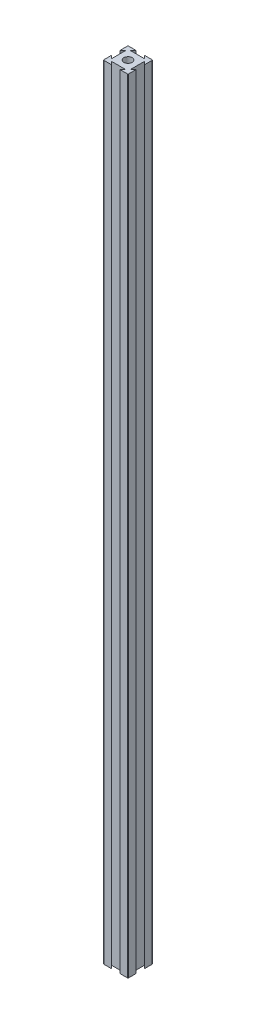
ISO-10303-21;
HEADER;
FILE_DESCRIPTION(('STEP AP214'),'2;1');
FILE_NAME('part.step','',(''),(''),'','','');
FILE_SCHEMA(('AUTOMOTIVE_DESIGN { 1 0 10303 214 1 1 1 1 }'));
ENDSEC;
DATA;
#1=APPLICATION_CONTEXT('core data for automotive mechanical design processes');
#2=APPLICATION_PROTOCOL_DEFINITION('international standard','automotive_design',2000,#1);
#3=PRODUCT_CONTEXT('',#1,'mechanical');
#4=PRODUCT('Part','Part','',(#3));
#5=PRODUCT_RELATED_PRODUCT_CATEGORY('part','',(#4));
#6=PRODUCT_DEFINITION_FORMATION('','',#4);
#7=PRODUCT_DEFINITION_CONTEXT('part definition',#1,'design');
#8=PRODUCT_DEFINITION('design','',#6,#7);
#9=PRODUCT_DEFINITION_SHAPE('','',#8);
#10=(LENGTH_UNIT() NAMED_UNIT(*) SI_UNIT(.MILLI.,.METRE.));
#11=(NAMED_UNIT(*) PLANE_ANGLE_UNIT() SI_UNIT($,.RADIAN.));
#12=(NAMED_UNIT(*) SI_UNIT($,.STERADIAN.) SOLID_ANGLE_UNIT());
#13=UNCERTAINTY_MEASURE_WITH_UNIT(LENGTH_MEASURE(1.E-05),#10,'distance_accuracy_value','');
#14=(GEOMETRIC_REPRESENTATION_CONTEXT(3) GLOBAL_UNCERTAINTY_ASSIGNED_CONTEXT((#13)) GLOBAL_UNIT_ASSIGNED_CONTEXT((#10,
#11,#12)) REPRESENTATION_CONTEXT('',''));
#15=CARTESIAN_POINT('',(0.,0.,0.));
#16=DIRECTION('',(0.,0.,1.));
#17=DIRECTION('',(1.,0.,0.));
#18=AXIS2_PLACEMENT_3D('',#15,#16,#17);
#19=CARTESIAN_POINT('',(16.6666666666667,635.,-16.6666666666667));
#20=DIRECTION('',(-0.707106781186547,0.,0.707106781186548));
#21=DIRECTION('',(0.707106781186548,0.,0.707106781186547));
#22=AXIS2_PLACEMENT_3D('',#19,#20,#21);
#23=PLANE('',#22);
#24=DIRECTION('',(-0.707106781186548,0.,-0.707106781186547));
#25=VECTOR('',#24,1.);
#26=CARTESIAN_POINT('',(16.6666666666667,0.,-16.6666666666667));
#27=LINE('',#26,#25);
#28=CARTESIAN_POINT('',(20.,0.,-13.3333333333333));
#29=VERTEX_POINT('',#28);
#30=CARTESIAN_POINT('',(17.6183333333333,0.,-15.715));
#31=VERTEX_POINT('',#30);
#32=EDGE_CURVE('E201',#29,#31,#27,.T.);
#33=ORIENTED_EDGE('',*,*,#32,.F.);
#34=DIRECTION('',(0.,-1.,0.));
#35=VECTOR('',#34,1.);
#36=CARTESIAN_POINT('',(20.,635.,-13.3333333333333));
#37=LINE('',#36,#35);
#38=CARTESIAN_POINT('',(20.,635.,-13.3333333333333));
#39=VERTEX_POINT('',#38);
#40=EDGE_CURVE('E195',#39,#29,#37,.T.);
#41=ORIENTED_EDGE('',*,*,#40,.F.);
#42=DIRECTION('',(-0.707106781186548,0.,-0.707106781186547));
#43=VECTOR('',#42,1.);
#44=CARTESIAN_POINT('',(16.6666666666667,635.,-16.6666666666667));
#45=LINE('',#44,#43);
#46=CARTESIAN_POINT('',(17.6183333333333,635.,-15.715));
#47=VERTEX_POINT('',#46);
#48=EDGE_CURVE('E198',#39,#47,#45,.T.);
#49=ORIENTED_EDGE('',*,*,#48,.T.);
#50=DIRECTION('',(0.,-1.,0.));
#51=VECTOR('',#50,1.);
#52=CARTESIAN_POINT('',(17.6183333333333,635.,-15.715));
#53=LINE('',#52,#51);
#54=EDGE_CURVE('E269',#47,#31,#53,.T.);
#55=ORIENTED_EDGE('',*,*,#54,.T.);
#56=EDGE_LOOP('',(#33,#41,#49,#55));
#57=FACE_BOUND('',#56,.T.);
#58=ADVANCED_FACE('F35',(#57),#23,.T.);
#59=CARTESIAN_POINT('',(20.,635.,0.));
#60=DIRECTION('',(-1.,0.,0.));
#61=DIRECTION('',(0.,0.,1.));
#62=AXIS2_PLACEMENT_3D('',#59,#60,#61);
#63=PLANE('',#62);
#64=DIRECTION('',(0.,0.,-1.));
#65=VECTOR('',#64,1.);
#66=CARTESIAN_POINT('',(20.,0.,0.));
#67=LINE('',#66,#65);
#68=CARTESIAN_POINT('',(20.,0.,-19.492));
#69=VERTEX_POINT('',#68);
#70=EDGE_CURVE('E274',#29,#69,#67,.T.);
#71=ORIENTED_EDGE('',*,*,#70,.T.);
#72=DIRECTION('',(0.,-1.,0.));
#73=VECTOR('',#72,1.);
#74=CARTESIAN_POINT('',(20.,635.,-19.492));
#75=LINE('',#74,#73);
#76=CARTESIAN_POINT('',(20.,635.,-19.492));
#77=VERTEX_POINT('',#76);
#78=EDGE_CURVE('E212',#69,#77,#75,.F.);
#79=ORIENTED_EDGE('',*,*,#78,.T.);
#80=DIRECTION('',(0.,0.,-1.));
#81=VECTOR('',#80,1.);
#82=CARTESIAN_POINT('',(20.,635.,0.));
#83=LINE('',#82,#81);
#84=EDGE_CURVE('E209',#39,#77,#83,.T.);
#85=ORIENTED_EDGE('',*,*,#84,.F.);
#86=ORIENTED_EDGE('',*,*,#40,.T.);
#87=EDGE_LOOP('',(#71,#79,#85,#86));
#88=FACE_BOUND('',#87,.T.);
#89=ADVANCED_FACE('F210',(#88),#63,.F.);
#90=CARTESIAN_POINT('',(0.,635.,-20.));
#91=DIRECTION('',(0.,0.,-1.));
#92=DIRECTION('',(-1.,0.,0.));
#93=AXIS2_PLACEMENT_3D('',#90,#91,#92);
#94=PLANE('',#93);
#95=DIRECTION('',(1.,0.,0.));
#96=VECTOR('',#95,1.);
#97=CARTESIAN_POINT('',(0.,635.,-20.));
#98=LINE('',#97,#96);
#99=CARTESIAN_POINT('',(13.3333333333333,635.,-20.));
#100=VERTEX_POINT('',#99);
#101=CARTESIAN_POINT('',(19.492,635.,-20.));
#102=VERTEX_POINT('',#101);
#103=EDGE_CURVE('E214',#100,#102,#98,.T.);
#104=ORIENTED_EDGE('',*,*,#103,.T.);
#105=DIRECTION('',(0.,-1.,0.));
#106=VECTOR('',#105,1.);
#107=CARTESIAN_POINT('',(19.492,0.,-20.));
#108=LINE('',#107,#106);
#109=CARTESIAN_POINT('',(19.492,0.,-20.));
#110=VERTEX_POINT('',#109);
#111=EDGE_CURVE('E376',#102,#110,#108,.T.);
#112=ORIENTED_EDGE('',*,*,#111,.T.);
#113=DIRECTION('',(1.,0.,0.));
#114=VECTOR('',#113,1.);
#115=CARTESIAN_POINT('',(0.,0.,-20.));
#116=LINE('',#115,#114);
#117=CARTESIAN_POINT('',(13.3333333333333,0.,-20.));
#118=VERTEX_POINT('',#117);
#119=EDGE_CURVE('E276',#118,#110,#116,.T.);
#120=ORIENTED_EDGE('',*,*,#119,.F.);
#121=DIRECTION('',(0.,-1.,0.));
#122=VECTOR('',#121,1.);
#123=CARTESIAN_POINT('',(13.3333333333333,635.,-20.));
#124=LINE('',#123,#122);
#125=EDGE_CURVE('E206',#100,#118,#124,.T.);
#126=ORIENTED_EDGE('',*,*,#125,.F.);
#127=EDGE_LOOP('',(#104,#112,#120,#126));
#128=FACE_BOUND('',#127,.T.);
#129=ADVANCED_FACE('F408',(#128),#94,.T.);
#130=CARTESIAN_POINT('',(16.6666666666666,635.,-16.6666666666668));
#131=DIRECTION('',(-0.707106781186544,0.,0.707106781186551));
#132=DIRECTION('',(0.707106781186551,0.,0.707106781186544));
#133=AXIS2_PLACEMENT_3D('',#130,#131,#132);
#134=PLANE('',#133);
#135=DIRECTION('',(-0.707106781186551,0.,-0.707106781186544));
#136=VECTOR('',#135,1.);
#137=CARTESIAN_POINT('',(16.6666666666666,0.,-16.6666666666668));
#138=LINE('',#137,#136);
#139=CARTESIAN_POINT('',(15.715,0.,-17.6183333333334));
#140=VERTEX_POINT('',#139);
#141=EDGE_CURVE('E280',#140,#118,#138,.T.);
#142=ORIENTED_EDGE('',*,*,#141,.F.);
#143=DIRECTION('',(0.,-1.,0.));
#144=VECTOR('',#143,1.);
#145=CARTESIAN_POINT('',(15.715,635.,-17.6183333333334));
#146=LINE('',#145,#144);
#147=CARTESIAN_POINT('',(15.715,635.,-17.6183333333334));
#148=VERTEX_POINT('',#147);
#149=EDGE_CURVE('E354',#148,#140,#146,.T.);
#150=ORIENTED_EDGE('',*,*,#149,.F.);
#151=DIRECTION('',(-0.707106781186551,0.,-0.707106781186544));
#152=VECTOR('',#151,1.);
#153=CARTESIAN_POINT('',(16.6666666666666,635.,-16.6666666666668));
#154=LINE('',#153,#152);
#155=EDGE_CURVE('E230',#148,#100,#154,.T.);
#156=ORIENTED_EDGE('',*,*,#155,.T.);
#157=ORIENTED_EDGE('',*,*,#125,.T.);
#158=EDGE_LOOP('',(#142,#150,#156,#157));
#159=FACE_BOUND('',#158,.T.);
#160=ADVANCED_FACE('F412',(#159),#134,.T.);
#161=CARTESIAN_POINT('',(0.,635.,-17.6183333333334));
#162=DIRECTION('',(0.,0.,-1.));
#163=DIRECTION('',(-1.,0.,0.));
#164=AXIS2_PLACEMENT_3D('',#161,#162,#163);
#165=PLANE('',#164);
#166=DIRECTION('',(1.,0.,0.));
#167=VECTOR('',#166,1.);
#168=CARTESIAN_POINT('',(0.,0.,-17.6183333333334));
#169=LINE('',#168,#167);
#170=CARTESIAN_POINT('',(4.285,0.,-17.6183333333334));
#171=VERTEX_POINT('',#170);
#172=EDGE_CURVE('E284',#171,#140,#169,.T.);
#173=ORIENTED_EDGE('',*,*,#172,.F.);
#174=DIRECTION('',(0.,-1.,0.));
#175=VECTOR('',#174,1.);
#176=CARTESIAN_POINT('',(4.285,635.,-17.6183333333334));
#177=LINE('',#176,#175);
#178=CARTESIAN_POINT('',(4.285,635.,-17.6183333333334));
#179=VERTEX_POINT('',#178);
#180=EDGE_CURVE('E352',#179,#171,#177,.T.);
#181=ORIENTED_EDGE('',*,*,#180,.F.);
#182=DIRECTION('',(1.,0.,0.));
#183=VECTOR('',#182,1.);
#184=CARTESIAN_POINT('',(0.,635.,-17.6183333333334));
#185=LINE('',#184,#183);
#186=EDGE_CURVE('E234',#179,#148,#185,.T.);
#187=ORIENTED_EDGE('',*,*,#186,.T.);
#188=ORIENTED_EDGE('',*,*,#149,.T.);
#189=EDGE_LOOP('',(#173,#181,#187,#188));
#190=FACE_BOUND('',#189,.T.);
#191=ADVANCED_FACE('F439',(#190),#165,.T.);
#192=CARTESIAN_POINT('',(-6.6666666666667,635.,-6.66666666666677));
#193=DIRECTION('',(0.707106781186544,0.,0.707106781186551));
#194=DIRECTION('',(0.707106781186551,0.,-0.707106781186544));
#195=AXIS2_PLACEMENT_3D('',#192,#193,#194);
#196=PLANE('',#195);
#197=DIRECTION('',(-0.707106781186551,0.,0.707106781186544));
#198=VECTOR('',#197,1.);
#199=CARTESIAN_POINT('',(-6.6666666666667,0.,-6.66666666666677));
#200=LINE('',#199,#198);
#201=CARTESIAN_POINT('',(6.66666666666666,0.,-20.));
#202=VERTEX_POINT('',#201);
#203=EDGE_CURVE('E287',#202,#171,#200,.T.);
#204=ORIENTED_EDGE('',*,*,#203,.F.);
#205=DIRECTION('',(0.,-1.,0.));
#206=VECTOR('',#205,1.);
#207=CARTESIAN_POINT('',(6.66666666666666,635.,-20.));
#208=LINE('',#207,#206);
#209=CARTESIAN_POINT('',(6.66666666666666,635.,-20.));
#210=VERTEX_POINT('',#209);
#211=EDGE_CURVE('E349',#210,#202,#208,.T.);
#212=ORIENTED_EDGE('',*,*,#211,.F.);
#213=DIRECTION('',(-0.707106781186551,0.,0.707106781186544));
#214=VECTOR('',#213,1.);
#215=CARTESIAN_POINT('',(-6.6666666666667,635.,-6.66666666666677));
#216=LINE('',#215,#214);
#217=EDGE_CURVE('E237',#210,#179,#216,.T.);
#218=ORIENTED_EDGE('',*,*,#217,.T.);
#219=ORIENTED_EDGE('',*,*,#180,.T.);
#220=EDGE_LOOP('',(#204,#212,#218,#219));
#221=FACE_BOUND('',#220,.T.);
#222=ADVANCED_FACE('F442',(#221),#196,.T.);
#223=CARTESIAN_POINT('',(0.508,0.,-20.));
#224=VERTEX_POINT('',#223);
#225=EDGE_CURVE('E281',#224,#202,#116,.T.);
#226=ORIENTED_EDGE('',*,*,#225,.F.);
#227=DIRECTION('',(0.,-1.,0.));
#228=VECTOR('',#227,1.);
#229=CARTESIAN_POINT('',(0.508,635.,-20.));
#230=LINE('',#229,#228);
#231=CARTESIAN_POINT('',(0.508,635.,-20.));
#232=VERTEX_POINT('',#231);
#233=EDGE_CURVE('E367',#224,#232,#230,.F.);
#234=ORIENTED_EDGE('',*,*,#233,.T.);
#235=EDGE_CURVE('E231',#232,#210,#98,.T.);
#236=ORIENTED_EDGE('',*,*,#235,.T.);
#237=ORIENTED_EDGE('',*,*,#211,.T.);
#238=EDGE_LOOP('',(#226,#234,#236,#237));
#239=FACE_BOUND('',#238,.T.);
#240=ADVANCED_FACE('F505',(#239),#94,.T.);
#241=CARTESIAN_POINT('',(0.,635.,0.));
#242=DIRECTION('',(-1.,0.,0.));
#243=DIRECTION('',(0.,0.,1.));
#244=AXIS2_PLACEMENT_3D('',#241,#242,#243);
#245=PLANE('',#244);
#246=DIRECTION('',(0.,0.,-1.));
#247=VECTOR('',#246,1.);
#248=CARTESIAN_POINT('',(0.,635.,0.));
#249=LINE('',#248,#247);
#250=CARTESIAN_POINT('',(0.,635.,-13.3333333333333));
#251=VERTEX_POINT('',#250);
#252=CARTESIAN_POINT('',(0.,635.,-19.492));
#253=VERTEX_POINT('',#252);
#254=EDGE_CURVE('E240',#251,#253,#249,.T.);
#255=ORIENTED_EDGE('',*,*,#254,.T.);
#256=DIRECTION('',(0.,-1.,0.));
#257=VECTOR('',#256,1.);
#258=CARTESIAN_POINT('',(0.,635.,-19.492));
#259=LINE('',#258,#257);
#260=CARTESIAN_POINT('',(0.,0.,-19.492));
#261=VERTEX_POINT('',#260);
#262=EDGE_CURVE('E205',#253,#261,#259,.T.);
#263=ORIENTED_EDGE('',*,*,#262,.T.);
#264=DIRECTION('',(0.,0.,-1.));
#265=VECTOR('',#264,1.);
#266=CARTESIAN_POINT('',(0.,0.,0.));
#267=LINE('',#266,#265);
#268=CARTESIAN_POINT('',(0.,0.,-13.3333333333333));
#269=VERTEX_POINT('',#268);
#270=EDGE_CURVE('E290',#269,#261,#267,.T.);
#271=ORIENTED_EDGE('',*,*,#270,.F.);
#272=DIRECTION('',(0.,-1.,0.));
#273=VECTOR('',#272,1.);
#274=CARTESIAN_POINT('',(0.,635.,-13.3333333333333));
#275=LINE('',#274,#273);
#276=EDGE_CURVE('E347',#251,#269,#275,.T.);
#277=ORIENTED_EDGE('',*,*,#276,.F.);
#278=EDGE_LOOP('',(#255,#263,#271,#277));
#279=FACE_BOUND('',#278,.T.);
#280=ADVANCED_FACE('F451',(#279),#245,.T.);
#281=CARTESIAN_POINT('',(-6.66666666666667,635.,-6.66666666666669));
#282=DIRECTION('',(-0.707106781186546,0.,-0.707106781186548));
#283=DIRECTION('',(-0.707106781186549,0.,0.707106781186547));
#284=AXIS2_PLACEMENT_3D('',#281,#282,#283);
#285=PLANE('',#284);
#286=DIRECTION('',(0.707106781186549,0.,-0.707106781186547));
#287=VECTOR('',#286,1.);
#288=CARTESIAN_POINT('',(-6.66666666666667,0.,-6.66666666666669));
#289=LINE('',#288,#287);
#290=CARTESIAN_POINT('',(2.38166666666667,0.,-15.715));
#291=VERTEX_POINT('',#290);
#292=EDGE_CURVE('E293',#269,#291,#289,.T.);
#293=ORIENTED_EDGE('',*,*,#292,.T.);
#294=DIRECTION('',(0.,-1.,0.));
#295=VECTOR('',#294,1.);
#296=CARTESIAN_POINT('',(2.38166666666667,635.,-15.715));
#297=LINE('',#296,#295);
#298=CARTESIAN_POINT('',(2.38166666666667,635.,-15.715));
#299=VERTEX_POINT('',#298);
#300=EDGE_CURVE('E344',#299,#291,#297,.T.);
#301=ORIENTED_EDGE('',*,*,#300,.F.);
#302=DIRECTION('',(0.707106781186549,0.,-0.707106781186547));
#303=VECTOR('',#302,1.);
#304=CARTESIAN_POINT('',(-6.66666666666667,635.,-6.66666666666669));
#305=LINE('',#304,#303);
#306=EDGE_CURVE('E243',#251,#299,#305,.T.);
#307=ORIENTED_EDGE('',*,*,#306,.F.);
#308=ORIENTED_EDGE('',*,*,#276,.T.);
#309=EDGE_LOOP('',(#293,#301,#307,#308));
#310=FACE_BOUND('',#309,.T.);
#311=ADVANCED_FACE('F456',(#310),#285,.F.);
#312=CARTESIAN_POINT('',(2.38166666666667,635.,0.));
#313=DIRECTION('',(1.,0.,0.));
#314=DIRECTION('',(0.,0.,-1.));
#315=AXIS2_PLACEMENT_3D('',#312,#313,#314);
#316=PLANE('',#315);
#317=DIRECTION('',(0.,0.,1.));
#318=VECTOR('',#317,1.);
#319=CARTESIAN_POINT('',(2.38166666666667,0.,0.));
#320=LINE('',#319,#318);
#321=CARTESIAN_POINT('',(2.38166666666667,0.,-4.285));
#322=VERTEX_POINT('',#321);
#323=EDGE_CURVE('E297',#291,#322,#320,.T.);
#324=ORIENTED_EDGE('',*,*,#323,.T.);
#325=DIRECTION('',(0.,-1.,0.));
#326=VECTOR('',#325,1.);
#327=CARTESIAN_POINT('',(2.38166666666667,635.,-4.285));
#328=LINE('',#327,#326);
#329=CARTESIAN_POINT('',(2.38166666666667,635.,-4.285));
#330=VERTEX_POINT('',#329);
#331=EDGE_CURVE('E341',#330,#322,#328,.T.);
#332=ORIENTED_EDGE('',*,*,#331,.F.);
#333=DIRECTION('',(0.,0.,1.));
#334=VECTOR('',#333,1.);
#335=CARTESIAN_POINT('',(2.38166666666667,635.,0.));
#336=LINE('',#335,#334);
#337=EDGE_CURVE('E247',#299,#330,#336,.T.);
#338=ORIENTED_EDGE('',*,*,#337,.F.);
#339=ORIENTED_EDGE('',*,*,#300,.T.);
#340=EDGE_LOOP('',(#324,#332,#338,#339));
#341=FACE_BOUND('',#340,.T.);
#342=ADVANCED_FACE('F462',(#341),#316,.F.);
#343=CARTESIAN_POINT('',(3.33333333333333,635.,-3.33333333333335));
#344=DIRECTION('',(-0.707106781186546,0.,0.707106781186549));
#345=DIRECTION('',(0.707106781186549,0.,0.707106781186546));
#346=AXIS2_PLACEMENT_3D('',#343,#344,#345);
#347=PLANE('',#346);
#348=DIRECTION('',(-0.707106781186549,0.,-0.707106781186546));
#349=VECTOR('',#348,1.);
#350=CARTESIAN_POINT('',(3.33333333333333,0.,-3.33333333333335));
#351=LINE('',#350,#349);
#352=CARTESIAN_POINT('',(0.,0.,-6.66666666666667));
#353=VERTEX_POINT('',#352);
#354=EDGE_CURVE('E300',#322,#353,#351,.T.);
#355=ORIENTED_EDGE('',*,*,#354,.T.);
#356=DIRECTION('',(0.,-1.,0.));
#357=VECTOR('',#356,1.);
#358=CARTESIAN_POINT('',(0.,635.,-6.66666666666667));
#359=LINE('',#358,#357);
#360=CARTESIAN_POINT('',(0.,635.,-6.66666666666667));
#361=VERTEX_POINT('',#360);
#362=EDGE_CURVE('E338',#361,#353,#359,.T.);
#363=ORIENTED_EDGE('',*,*,#362,.F.);
#364=DIRECTION('',(-0.707106781186549,0.,-0.707106781186546));
#365=VECTOR('',#364,1.);
#366=CARTESIAN_POINT('',(3.33333333333333,635.,-3.33333333333335));
#367=LINE('',#366,#365);
#368=EDGE_CURVE('E250',#330,#361,#367,.T.);
#369=ORIENTED_EDGE('',*,*,#368,.F.);
#370=ORIENTED_EDGE('',*,*,#331,.T.);
#371=EDGE_LOOP('',(#355,#363,#369,#370));
#372=FACE_BOUND('',#371,.T.);
#373=ADVANCED_FACE('F464',(#372),#347,.F.);
#374=CARTESIAN_POINT('',(0.,0.,-0.508));
#375=VERTEX_POINT('',#374);
#376=EDGE_CURVE('E294',#375,#353,#267,.T.);
#377=ORIENTED_EDGE('',*,*,#376,.F.);
#378=DIRECTION('',(0.,-1.,0.));
#379=VECTOR('',#378,1.);
#380=CARTESIAN_POINT('',(0.,635.,-0.508));
#381=LINE('',#380,#379);
#382=CARTESIAN_POINT('',(0.,635.,-0.508));
#383=VERTEX_POINT('',#382);
#384=EDGE_CURVE('E383',#375,#383,#381,.F.);
#385=ORIENTED_EDGE('',*,*,#384,.T.);
#386=EDGE_CURVE('E244',#383,#361,#249,.T.);
#387=ORIENTED_EDGE('',*,*,#386,.T.);
#388=ORIENTED_EDGE('',*,*,#362,.T.);
#389=EDGE_LOOP('',(#377,#385,#387,#388));
#390=FACE_BOUND('',#389,.T.);
#391=ADVANCED_FACE('F467',(#390),#245,.T.);
#392=CARTESIAN_POINT('',(0.,635.,0.));
#393=DIRECTION('',(0.,0.,-1.));
#394=DIRECTION('',(-1.,0.,0.));
#395=AXIS2_PLACEMENT_3D('',#392,#393,#394);
#396=PLANE('',#395);
#397=DIRECTION('',(1.,0.,0.));
#398=VECTOR('',#397,1.);
#399=CARTESIAN_POINT('',(0.,635.,0.));
#400=LINE('',#399,#398);
#401=CARTESIAN_POINT('',(0.508,635.,0.));
#402=VERTEX_POINT('',#401);
#403=CARTESIAN_POINT('',(6.66666666666667,635.,0.));
#404=VERTEX_POINT('',#403);
#405=EDGE_CURVE('E253',#402,#404,#400,.T.);
#406=ORIENTED_EDGE('',*,*,#405,.F.);
#407=DIRECTION('',(0.,-1.,0.));
#408=VECTOR('',#407,1.);
#409=CARTESIAN_POINT('',(0.508,0.,0.));
#410=LINE('',#409,#408);
#411=CARTESIAN_POINT('',(0.508,0.,0.));
#412=VERTEX_POINT('',#411);
#413=EDGE_CURVE('E380',#402,#412,#410,.T.);
#414=ORIENTED_EDGE('',*,*,#413,.T.);
#415=DIRECTION('',(1.,0.,0.));
#416=VECTOR('',#415,1.);
#417=CARTESIAN_POINT('',(0.,0.,0.));
#418=LINE('',#417,#416);
#419=CARTESIAN_POINT('',(6.66666666666667,0.,0.));
#420=VERTEX_POINT('',#419);
#421=EDGE_CURVE('E303',#412,#420,#418,.T.);
#422=ORIENTED_EDGE('',*,*,#421,.T.);
#423=DIRECTION('',(0.,-1.,0.));
#424=VECTOR('',#423,1.);
#425=CARTESIAN_POINT('',(6.66666666666667,635.,0.));
#426=LINE('',#425,#424);
#427=EDGE_CURVE('E335',#404,#420,#426,.T.);
#428=ORIENTED_EDGE('',*,*,#427,.F.);
#429=EDGE_LOOP('',(#406,#414,#422,#428));
#430=FACE_BOUND('',#429,.T.);
#431=ADVANCED_FACE('F474',(#430),#396,.F.);
#432=CARTESIAN_POINT('',(3.3333333333333,635.,-3.33333333333333));
#433=DIRECTION('',(-0.707106781186544,0.,0.707106781186551));
#434=DIRECTION('',(0.707106781186551,0.,0.707106781186544));
#435=AXIS2_PLACEMENT_3D('',#432,#433,#434);
#436=PLANE('',#435);
#437=DIRECTION('',(-0.707106781186551,0.,-0.707106781186544));
#438=VECTOR('',#437,1.);
#439=CARTESIAN_POINT('',(3.3333333333333,0.,-3.33333333333333));
#440=LINE('',#439,#438);
#441=CARTESIAN_POINT('',(4.285,0.,-2.38166666666664));
#442=VERTEX_POINT('',#441);
#443=EDGE_CURVE('E305',#420,#442,#440,.T.);
#444=ORIENTED_EDGE('',*,*,#443,.T.);
#445=DIRECTION('',(0.,-1.,0.));
#446=VECTOR('',#445,1.);
#447=CARTESIAN_POINT('',(4.285,635.,-2.38166666666664));
#448=LINE('',#447,#446);
#449=CARTESIAN_POINT('',(4.285,635.,-2.38166666666664));
#450=VERTEX_POINT('',#449);
#451=EDGE_CURVE('E332',#450,#442,#448,.T.);
#452=ORIENTED_EDGE('',*,*,#451,.F.);
#453=DIRECTION('',(-0.707106781186551,0.,-0.707106781186544));
#454=VECTOR('',#453,1.);
#455=CARTESIAN_POINT('',(3.3333333333333,635.,-3.33333333333333));
#456=LINE('',#455,#454);
#457=EDGE_CURVE('E255',#404,#450,#456,.T.);
#458=ORIENTED_EDGE('',*,*,#457,.F.);
#459=ORIENTED_EDGE('',*,*,#427,.T.);
#460=EDGE_LOOP('',(#444,#452,#458,#459));
#461=FACE_BOUND('',#460,.T.);
#462=ADVANCED_FACE('F480',(#461),#436,.F.);
#463=CARTESIAN_POINT('',(0.,635.,-2.38166666666664));
#464=DIRECTION('',(0.,0.,-1.));
#465=DIRECTION('',(-1.,0.,0.));
#466=AXIS2_PLACEMENT_3D('',#463,#464,#465);
#467=PLANE('',#466);
#468=DIRECTION('',(1.,0.,0.));
#469=VECTOR('',#468,1.);
#470=CARTESIAN_POINT('',(0.,0.,-2.38166666666664));
#471=LINE('',#470,#469);
#472=CARTESIAN_POINT('',(15.715,0.,-2.38166666666664));
#473=VERTEX_POINT('',#472);
#474=EDGE_CURVE('E309',#442,#473,#471,.T.);
#475=ORIENTED_EDGE('',*,*,#474,.T.);
#476=DIRECTION('',(0.,-1.,0.));
#477=VECTOR('',#476,1.);
#478=CARTESIAN_POINT('',(15.715,635.,-2.38166666666664));
#479=LINE('',#478,#477);
#480=CARTESIAN_POINT('',(15.715,635.,-2.38166666666664));
#481=VERTEX_POINT('',#480);
#482=EDGE_CURVE('E329',#481,#473,#479,.T.);
#483=ORIENTED_EDGE('',*,*,#482,.F.);
#484=DIRECTION('',(1.,0.,0.));
#485=VECTOR('',#484,1.);
#486=CARTESIAN_POINT('',(0.,635.,-2.38166666666664));
#487=LINE('',#486,#485);
#488=EDGE_CURVE('E259',#450,#481,#487,.T.);
#489=ORIENTED_EDGE('',*,*,#488,.F.);
#490=ORIENTED_EDGE('',*,*,#451,.T.);
#491=EDGE_LOOP('',(#475,#483,#489,#490));
#492=FACE_BOUND('',#491,.T.);
#493=ADVANCED_FACE('F483',(#492),#467,.F.);
#494=CARTESIAN_POINT('',(6.66666666666659,635.,6.66666666666667));
#495=DIRECTION('',(0.707106781186544,0.,0.707106781186551));
#496=DIRECTION('',(0.707106781186551,0.,-0.707106781186544));
#497=AXIS2_PLACEMENT_3D('',#494,#495,#496);
#498=PLANE('',#497);
#499=DIRECTION('',(-0.707106781186551,0.,0.707106781186544));
#500=VECTOR('',#499,1.);
#501=CARTESIAN_POINT('',(6.66666666666659,0.,6.66666666666667));
#502=LINE('',#501,#500);
#503=CARTESIAN_POINT('',(13.3333333333333,0.,0.));
#504=VERTEX_POINT('',#503);
#505=EDGE_CURVE('E312',#473,#504,#502,.T.);
#506=ORIENTED_EDGE('',*,*,#505,.T.);
#507=DIRECTION('',(0.,-1.,0.));
#508=VECTOR('',#507,1.);
#509=CARTESIAN_POINT('',(13.3333333333333,635.,0.));
#510=LINE('',#509,#508);
#511=CARTESIAN_POINT('',(13.3333333333333,635.,0.));
#512=VERTEX_POINT('',#511);
#513=EDGE_CURVE('E326',#512,#504,#510,.T.);
#514=ORIENTED_EDGE('',*,*,#513,.F.);
#515=DIRECTION('',(-0.707106781186551,0.,0.707106781186544));
#516=VECTOR('',#515,1.);
#517=CARTESIAN_POINT('',(6.66666666666659,635.,6.66666666666667));
#518=LINE('',#517,#516);
#519=EDGE_CURVE('E262',#481,#512,#518,.T.);
#520=ORIENTED_EDGE('',*,*,#519,.F.);
#521=ORIENTED_EDGE('',*,*,#482,.T.);
#522=EDGE_LOOP('',(#506,#514,#520,#521));
#523=FACE_BOUND('',#522,.T.);
#524=ADVANCED_FACE('F485',(#523),#498,.F.);
#525=CARTESIAN_POINT('',(19.492,0.,0.));
#526=VERTEX_POINT('',#525);
#527=EDGE_CURVE('E306',#504,#526,#418,.T.);
#528=ORIENTED_EDGE('',*,*,#527,.T.);
#529=DIRECTION('',(0.,-1.,0.));
#530=VECTOR('',#529,1.);
#531=CARTESIAN_POINT('',(19.492,635.,0.));
#532=LINE('',#531,#530);
#533=CARTESIAN_POINT('',(19.492,635.,0.));
#534=VERTEX_POINT('',#533);
#535=EDGE_CURVE('E11',#526,#534,#532,.F.);
#536=ORIENTED_EDGE('',*,*,#535,.T.);
#537=EDGE_CURVE('E256',#512,#534,#400,.T.);
#538=ORIENTED_EDGE('',*,*,#537,.F.);
#539=ORIENTED_EDGE('',*,*,#513,.T.);
#540=EDGE_LOOP('',(#528,#536,#538,#539));
#541=FACE_BOUND('',#540,.T.);
#542=ADVANCED_FACE('F394',(#541),#396,.F.);
#543=CARTESIAN_POINT('',(20.,635.,-0.508));
#544=VERTEX_POINT('',#543);
#545=CARTESIAN_POINT('',(20.,635.,-6.66666666666667));
#546=VERTEX_POINT('',#545);
#547=EDGE_CURVE('E216',#544,#546,#83,.T.);
#548=ORIENTED_EDGE('',*,*,#547,.F.);
#549=DIRECTION('',(0.,-1.,0.));
#550=VECTOR('',#549,1.);
#551=CARTESIAN_POINT('',(20.,635.,-0.508));
#552=LINE('',#551,#550);
#553=CARTESIAN_POINT('',(20.,0.,-0.508));
#554=VERTEX_POINT('',#553);
#555=EDGE_CURVE('E43',#544,#554,#552,.T.);
#556=ORIENTED_EDGE('',*,*,#555,.T.);
#557=CARTESIAN_POINT('',(20.,0.,-6.66666666666667));
#558=VERTEX_POINT('',#557);
#559=EDGE_CURVE('E277',#554,#558,#67,.T.);
#560=ORIENTED_EDGE('',*,*,#559,.T.);
#561=DIRECTION('',(0.,-1.,0.));
#562=VECTOR('',#561,1.);
#563=CARTESIAN_POINT('',(20.,635.,-6.66666666666667));
#564=LINE('',#563,#562);
#565=EDGE_CURVE('E323',#546,#558,#564,.T.);
#566=ORIENTED_EDGE('',*,*,#565,.F.);
#567=EDGE_LOOP('',(#548,#556,#560,#566));
#568=FACE_BOUND('',#567,.T.);
#569=ADVANCED_FACE('F388',(#568),#63,.F.);
#570=CARTESIAN_POINT('',(6.66666666666663,635.,6.66666666666666));
#571=DIRECTION('',(-0.707106781186546,0.,-0.707106781186549));
#572=DIRECTION('',(-0.707106781186549,0.,0.707106781186546));
#573=AXIS2_PLACEMENT_3D('',#570,#571,#572);
#574=PLANE('',#573);
#575=DIRECTION('',(0.707106781186549,0.,-0.707106781186546));
#576=VECTOR('',#575,1.);
#577=CARTESIAN_POINT('',(6.66666666666663,0.,6.66666666666666));
#578=LINE('',#577,#576);
#579=CARTESIAN_POINT('',(17.6183333333333,0.,-4.285));
#580=VERTEX_POINT('',#579);
#581=EDGE_CURVE('E315',#580,#558,#578,.T.);
#582=ORIENTED_EDGE('',*,*,#581,.F.);
#583=DIRECTION('',(0.,-1.,0.));
#584=VECTOR('',#583,1.);
#585=CARTESIAN_POINT('',(17.6183333333333,635.,-4.285));
#586=LINE('',#585,#584);
#587=CARTESIAN_POINT('',(17.6183333333333,635.,-4.285));
#588=VERTEX_POINT('',#587);
#589=EDGE_CURVE('E321',#588,#580,#586,.T.);
#590=ORIENTED_EDGE('',*,*,#589,.F.);
#591=DIRECTION('',(0.707106781186549,0.,-0.707106781186546));
#592=VECTOR('',#591,1.);
#593=CARTESIAN_POINT('',(6.66666666666663,635.,6.66666666666666));
#594=LINE('',#593,#592);
#595=EDGE_CURVE('E265',#588,#546,#594,.T.);
#596=ORIENTED_EDGE('',*,*,#595,.T.);
#597=ORIENTED_EDGE('',*,*,#565,.T.);
#598=EDGE_LOOP('',(#582,#590,#596,#597));
#599=FACE_BOUND('',#598,.T.);
#600=ADVANCED_FACE('F418',(#599),#574,.T.);
#601=CARTESIAN_POINT('',(10.,635.,-10.));
#602=DIRECTION('',(0.,-1.,0.));
#603=DIRECTION('',(0.,0.,-1.));
#604=AXIS2_PLACEMENT_3D('',#601,#602,#603);
#605=CYLINDRICAL_SURFACE('',#604,3.33333333333333);
#606=CARTESIAN_POINT('',(10.,635.,-10.));
#607=DIRECTION('',(0.,1.,0.));
#608=DIRECTION('',(0.,0.,1.));
#609=AXIS2_PLACEMENT_3D('',#606,#607,#608);
#610=CIRCLE('',#609,3.33333333333333);
#611=CARTESIAN_POINT('',(10.,635.,-6.66666666666667));
#612=VERTEX_POINT('',#611);
#613=EDGE_CURVE('E222',#612,#612,#610,.T.);
#614=ORIENTED_EDGE('',*,*,#613,.T.);
#615=EDGE_LOOP('',(#614));
#616=FACE_BOUND('',#615,.T.);
#617=CARTESIAN_POINT('',(10.,0.,-10.));
#618=DIRECTION('',(0.,1.,0.));
#619=DIRECTION('',(0.,0.,1.));
#620=AXIS2_PLACEMENT_3D('',#617,#618,#619);
#621=CIRCLE('',#620,3.33333333333333);
#622=CARTESIAN_POINT('',(10.,0.,-6.66666666666667));
#623=VERTEX_POINT('',#622);
#624=EDGE_CURVE('E270',#623,#623,#621,.T.);
#625=ORIENTED_EDGE('',*,*,#624,.F.);
#626=EDGE_LOOP('',(#625));
#627=FACE_BOUND('',#626,.T.);
#628=ADVANCED_FACE('F414',(#616,#627),#605,.F.);
#629=CARTESIAN_POINT('',(17.6183333333333,635.,0.));
#630=DIRECTION('',(1.,0.,0.));
#631=DIRECTION('',(0.,0.,-1.));
#632=AXIS2_PLACEMENT_3D('',#629,#630,#631);
#633=PLANE('',#632);
#634=DIRECTION('',(0.,0.,1.));
#635=VECTOR('',#634,1.);
#636=CARTESIAN_POINT('',(17.6183333333333,0.,0.));
#637=LINE('',#636,#635);
#638=EDGE_CURVE('E225',#31,#580,#637,.T.);
#639=ORIENTED_EDGE('',*,*,#638,.F.);
#640=ORIENTED_EDGE('',*,*,#54,.F.);
#641=DIRECTION('',(0.,0.,1.));
#642=VECTOR('',#641,1.);
#643=CARTESIAN_POINT('',(17.6183333333333,635.,0.));
#644=LINE('',#643,#642);
#645=EDGE_CURVE('E221',#47,#588,#644,.T.);
#646=ORIENTED_EDGE('',*,*,#645,.T.);
#647=ORIENTED_EDGE('',*,*,#589,.T.);
#648=EDGE_LOOP('',(#639,#640,#646,#647));
#649=FACE_BOUND('',#648,.T.);
#650=ADVANCED_FACE('F417',(#649),#633,.T.);
#651=CARTESIAN_POINT('',(0.,635.,0.));
#652=DIRECTION('',(0.,1.,0.));
#653=DIRECTION('',(0.,0.,1.));
#654=AXIS2_PLACEMENT_3D('',#651,#652,#653);
#655=PLANE('',#654);
#656=ORIENTED_EDGE('',*,*,#613,.F.);
#657=EDGE_LOOP('',(#656));
#658=FACE_BOUND('',#657,.T.);
#659=ORIENTED_EDGE('',*,*,#235,.F.);
#660=CARTESIAN_POINT('',(0.508,635.,-19.492));
#661=DIRECTION('',(0.,1.,0.));
#662=DIRECTION('',(0.,0.,1.));
#663=AXIS2_PLACEMENT_3D('',#660,#661,#662);
#664=CIRCLE('',#663,0.508);
#665=EDGE_CURVE('E374',#232,#253,#664,.T.);
#666=ORIENTED_EDGE('',*,*,#665,.T.);
#667=ORIENTED_EDGE('',*,*,#254,.F.);
#668=ORIENTED_EDGE('',*,*,#306,.T.);
#669=ORIENTED_EDGE('',*,*,#337,.T.);
#670=ORIENTED_EDGE('',*,*,#368,.T.);
#671=ORIENTED_EDGE('',*,*,#386,.F.);
#672=CARTESIAN_POINT('',(0.508,635.,-0.508));
#673=DIRECTION('',(0.,1.,0.));
#674=DIRECTION('',(0.,0.,1.));
#675=AXIS2_PLACEMENT_3D('',#672,#673,#674);
#676=CIRCLE('',#675,0.508);
#677=EDGE_CURVE('E370',#383,#402,#676,.T.);
#678=ORIENTED_EDGE('',*,*,#677,.T.);
#679=ORIENTED_EDGE('',*,*,#405,.T.);
#680=ORIENTED_EDGE('',*,*,#457,.T.);
#681=ORIENTED_EDGE('',*,*,#488,.T.);
#682=ORIENTED_EDGE('',*,*,#519,.T.);
#683=ORIENTED_EDGE('',*,*,#537,.T.);
#684=CARTESIAN_POINT('',(19.492,635.,-0.508));
#685=DIRECTION('',(0.,1.,0.));
#686=DIRECTION('',(0.,0.,1.));
#687=AXIS2_PLACEMENT_3D('',#684,#685,#686);
#688=CIRCLE('',#687,0.508);
#689=EDGE_CURVE('E50',#534,#544,#688,.T.);
#690=ORIENTED_EDGE('',*,*,#689,.T.);
#691=ORIENTED_EDGE('',*,*,#547,.T.);
#692=ORIENTED_EDGE('',*,*,#595,.F.);
#693=ORIENTED_EDGE('',*,*,#645,.F.);
#694=ORIENTED_EDGE('',*,*,#48,.F.);
#695=ORIENTED_EDGE('',*,*,#84,.T.);
#696=CARTESIAN_POINT('',(19.492,635.,-19.492));
#697=DIRECTION('',(0.,1.,0.));
#698=DIRECTION('',(0.,0.,1.));
#699=AXIS2_PLACEMENT_3D('',#696,#697,#698);
#700=CIRCLE('',#699,0.508);
#701=EDGE_CURVE('E372',#77,#102,#700,.T.);
#702=ORIENTED_EDGE('',*,*,#701,.T.);
#703=ORIENTED_EDGE('',*,*,#103,.F.);
#704=ORIENTED_EDGE('',*,*,#155,.F.);
#705=ORIENTED_EDGE('',*,*,#186,.F.);
#706=ORIENTED_EDGE('',*,*,#217,.F.);
#707=EDGE_LOOP('',(#659,#666,#667,#668,#669,#670,#671,#678,#679,#680,#681,#682,#683,#690,#691,
#692,#693,#694,#695,#702,#703,#704,#705,#706));
#708=FACE_BOUND('',#707,.T.);
#709=ADVANCED_FACE('F218',(#658,#708),#655,.T.);
#710=CARTESIAN_POINT('',(0.,0.,0.));
#711=DIRECTION('',(0.,1.,0.));
#712=DIRECTION('',(0.,0.,1.));
#713=AXIS2_PLACEMENT_3D('',#710,#711,#712);
#714=PLANE('',#713);
#715=ORIENTED_EDGE('',*,*,#624,.T.);
#716=EDGE_LOOP('',(#715));
#717=FACE_BOUND('',#716,.T.);
#718=ORIENTED_EDGE('',*,*,#270,.T.);
#719=CARTESIAN_POINT('',(0.508,0.,-19.492));
#720=DIRECTION('',(0.,1.,0.));
#721=DIRECTION('',(0.,0.,1.));
#722=AXIS2_PLACEMENT_3D('',#719,#720,#721);
#723=CIRCLE('',#722,0.508);
#724=EDGE_CURVE('E365',#261,#224,#723,.F.);
#725=ORIENTED_EDGE('',*,*,#724,.T.);
#726=ORIENTED_EDGE('',*,*,#225,.T.);
#727=ORIENTED_EDGE('',*,*,#203,.T.);
#728=ORIENTED_EDGE('',*,*,#172,.T.);
#729=ORIENTED_EDGE('',*,*,#141,.T.);
#730=ORIENTED_EDGE('',*,*,#119,.T.);
#731=CARTESIAN_POINT('',(19.492,0.,-19.492));
#732=DIRECTION('',(0.,1.,0.));
#733=DIRECTION('',(0.,0.,1.));
#734=AXIS2_PLACEMENT_3D('',#731,#732,#733);
#735=CIRCLE('',#734,0.508);
#736=EDGE_CURVE('E363',#110,#69,#735,.F.);
#737=ORIENTED_EDGE('',*,*,#736,.T.);
#738=ORIENTED_EDGE('',*,*,#70,.F.);
#739=ORIENTED_EDGE('',*,*,#32,.T.);
#740=ORIENTED_EDGE('',*,*,#638,.T.);
#741=ORIENTED_EDGE('',*,*,#581,.T.);
#742=ORIENTED_EDGE('',*,*,#559,.F.);
#743=CARTESIAN_POINT('',(19.492,0.,-0.508));
#744=DIRECTION('',(0.,1.,0.));
#745=DIRECTION('',(0.,0.,1.));
#746=AXIS2_PLACEMENT_3D('',#743,#744,#745);
#747=CIRCLE('',#746,0.508);
#748=EDGE_CURVE('E359',#554,#526,#747,.F.);
#749=ORIENTED_EDGE('',*,*,#748,.T.);
#750=ORIENTED_EDGE('',*,*,#527,.F.);
#751=ORIENTED_EDGE('',*,*,#505,.F.);
#752=ORIENTED_EDGE('',*,*,#474,.F.);
#753=ORIENTED_EDGE('',*,*,#443,.F.);
#754=ORIENTED_EDGE('',*,*,#421,.F.);
#755=CARTESIAN_POINT('',(0.508,0.,-0.508));
#756=DIRECTION('',(0.,1.,0.));
#757=DIRECTION('',(0.,0.,1.));
#758=AXIS2_PLACEMENT_3D('',#755,#756,#757);
#759=CIRCLE('',#758,0.508);
#760=EDGE_CURVE('E361',#412,#375,#759,.F.);
#761=ORIENTED_EDGE('',*,*,#760,.T.);
#762=ORIENTED_EDGE('',*,*,#376,.T.);
#763=ORIENTED_EDGE('',*,*,#354,.F.);
#764=ORIENTED_EDGE('',*,*,#323,.F.);
#765=ORIENTED_EDGE('',*,*,#292,.F.);
#766=EDGE_LOOP('',(#718,#725,#726,#727,#728,#729,#730,#737,#738,#739,#740,#741,#742,#749,#750,
#751,#752,#753,#754,#761,#762,#763,#764,#765));
#767=FACE_BOUND('',#766,.T.);
#768=ADVANCED_FACE('F392',(#717,#767),#714,.F.);
#769=CARTESIAN_POINT('',(0.508,635.,-19.492));
#770=DIRECTION('',(0.,-1.,0.));
#771=DIRECTION('',(0.,0.,-1.));
#772=AXIS2_PLACEMENT_3D('',#769,#770,#771);
#773=CYLINDRICAL_SURFACE('',#772,0.508);
#774=ORIENTED_EDGE('',*,*,#665,.F.);
#775=ORIENTED_EDGE('',*,*,#233,.F.);
#776=ORIENTED_EDGE('',*,*,#724,.F.);
#777=ORIENTED_EDGE('',*,*,#262,.F.);
#778=EDGE_LOOP('',(#774,#775,#776,#777));
#779=FACE_BOUND('',#778,.T.);
#780=ADVANCED_FACE('F420',(#779),#773,.T.);
#781=CARTESIAN_POINT('',(19.492,635.,-19.492));
#782=DIRECTION('',(0.,1.,0.));
#783=DIRECTION('',(0.,0.,1.));
#784=AXIS2_PLACEMENT_3D('',#781,#782,#783);
#785=CYLINDRICAL_SURFACE('',#784,0.508);
#786=ORIENTED_EDGE('',*,*,#701,.F.);
#787=ORIENTED_EDGE('',*,*,#78,.F.);
#788=ORIENTED_EDGE('',*,*,#736,.F.);
#789=ORIENTED_EDGE('',*,*,#111,.F.);
#790=EDGE_LOOP('',(#786,#787,#788,#789));
#791=FACE_BOUND('',#790,.T.);
#792=ADVANCED_FACE('F401',(#791),#785,.T.);
#793=CARTESIAN_POINT('',(0.508,635.,-0.508));
#794=DIRECTION('',(0.,1.,0.));
#795=DIRECTION('',(0.,0.,1.));
#796=AXIS2_PLACEMENT_3D('',#793,#794,#795);
#797=CYLINDRICAL_SURFACE('',#796,0.508);
#798=ORIENTED_EDGE('',*,*,#677,.F.);
#799=ORIENTED_EDGE('',*,*,#384,.F.);
#800=ORIENTED_EDGE('',*,*,#760,.F.);
#801=ORIENTED_EDGE('',*,*,#413,.F.);
#802=EDGE_LOOP('',(#798,#799,#800,#801));
#803=FACE_BOUND('',#802,.T.);
#804=ADVANCED_FACE('F397',(#803),#797,.T.);
#805=CARTESIAN_POINT('',(19.492,635.,-0.508));
#806=DIRECTION('',(0.,-1.,0.));
#807=DIRECTION('',(0.,0.,-1.));
#808=AXIS2_PLACEMENT_3D('',#805,#806,#807);
#809=CYLINDRICAL_SURFACE('',#808,0.508);
#810=ORIENTED_EDGE('',*,*,#689,.F.);
#811=ORIENTED_EDGE('',*,*,#535,.F.);
#812=ORIENTED_EDGE('',*,*,#748,.F.);
#813=ORIENTED_EDGE('',*,*,#555,.F.);
#814=EDGE_LOOP('',(#810,#811,#812,#813));
#815=FACE_BOUND('',#814,.T.);
#816=ADVANCED_FACE('F37',(#815),#809,.T.);
#817=CLOSED_SHELL('',(#58,#89,#129,#160,#191,#222,#240,#280,#311,#342,#373,#391,#431,#462,#493,
#524,#542,#569,#600,#628,#650,#709,#768,#780,#792,#804,#816));
#818=MANIFOLD_SOLID_BREP('B2',#817);
#819=ADVANCED_BREP_SHAPE_REPRESENTATION('',(#18,#818),#14);
#820=SHAPE_DEFINITION_REPRESENTATION(#9,#819);
ENDSEC;
END-ISO-10303-21;
